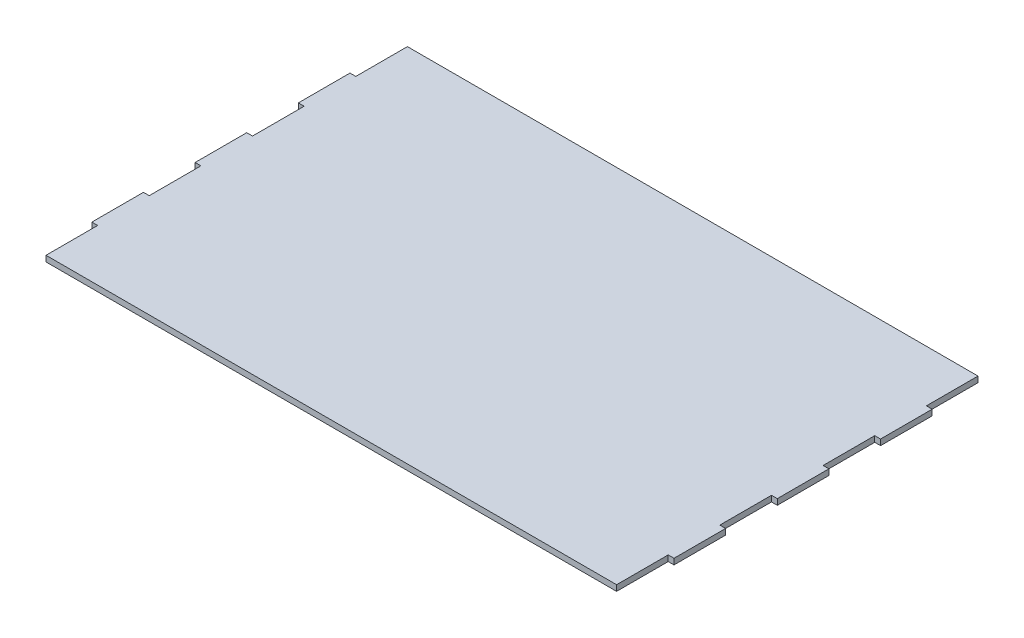
ISO-10303-21;
HEADER;
FILE_DESCRIPTION(('STEP AP214'),'2;1');
FILE_NAME('part.step','',(''),(''),'','','');
FILE_SCHEMA(('AUTOMOTIVE_DESIGN { 1 0 10303 214 1 1 1 1 }'));
ENDSEC;
DATA;
#1=APPLICATION_CONTEXT('core data for automotive mechanical design processes');
#2=APPLICATION_PROTOCOL_DEFINITION('international standard','automotive_design',2000,#1);
#3=PRODUCT_CONTEXT('',#1,'mechanical');
#4=PRODUCT('Part','Part','',(#3));
#5=PRODUCT_RELATED_PRODUCT_CATEGORY('part','',(#4));
#6=PRODUCT_DEFINITION_FORMATION('','',#4);
#7=PRODUCT_DEFINITION_CONTEXT('part definition',#1,'design');
#8=PRODUCT_DEFINITION('design','',#6,#7);
#9=PRODUCT_DEFINITION_SHAPE('','',#8);
#10=(LENGTH_UNIT() NAMED_UNIT(*) SI_UNIT(.MILLI.,.METRE.));
#11=(NAMED_UNIT(*) PLANE_ANGLE_UNIT() SI_UNIT($,.RADIAN.));
#12=(NAMED_UNIT(*) SI_UNIT($,.STERADIAN.) SOLID_ANGLE_UNIT());
#13=UNCERTAINTY_MEASURE_WITH_UNIT(LENGTH_MEASURE(1.E-05),#10,'distance_accuracy_value','');
#14=(GEOMETRIC_REPRESENTATION_CONTEXT(3) GLOBAL_UNCERTAINTY_ASSIGNED_CONTEXT((#13)) GLOBAL_UNIT_ASSIGNED_CONTEXT((#10,
#11,#12)) REPRESENTATION_CONTEXT('',''));
#15=CARTESIAN_POINT('',(0.,0.,0.));
#16=DIRECTION('',(0.,0.,1.));
#17=DIRECTION('',(1.,0.,0.));
#18=AXIS2_PLACEMENT_3D('',#15,#16,#17);
#19=CARTESIAN_POINT('',(-136.186205063659,3.,-47.9901598190306));
#20=DIRECTION('',(1.,0.,0.));
#21=DIRECTION('',(0.,0.,-1.));
#22=AXIS2_PLACEMENT_3D('',#19,#20,#21);
#23=PLANE('',#22);
#24=DIRECTION('',(0.,0.,1.));
#25=VECTOR('',#24,1.);
#26=CARTESIAN_POINT('',(-136.186205063659,0.,-47.9901598190306));
#27=LINE('',#26,#25);
#28=CARTESIAN_POINT('',(-136.186205063659,0.,-74.6901598190306));
#29=VERTEX_POINT('',#28);
#30=CARTESIAN_POINT('',(-136.186205063659,0.,-47.9901598190306));
#31=VERTEX_POINT('',#30);
#32=EDGE_CURVE('E257',#29,#31,#27,.T.);
#33=ORIENTED_EDGE('',*,*,#32,.T.);
#34=DIRECTION('',(0.,-1.,0.));
#35=VECTOR('',#34,1.);
#36=CARTESIAN_POINT('',(-136.186205063659,3.,-47.9901598190306));
#37=LINE('',#36,#35);
#38=CARTESIAN_POINT('',(-136.186205063659,3.,-47.9901598190306));
#39=VERTEX_POINT('',#38);
#40=EDGE_CURVE('E11',#39,#31,#37,.T.);
#41=ORIENTED_EDGE('',*,*,#40,.F.);
#42=DIRECTION('',(0.,0.,1.));
#43=VECTOR('',#42,1.);
#44=CARTESIAN_POINT('',(-136.186205063659,3.,-47.9901598190306));
#45=LINE('',#44,#43);
#46=CARTESIAN_POINT('',(-136.186205063659,3.,-74.6901598190306));
#47=VERTEX_POINT('',#46);
#48=EDGE_CURVE('E311',#47,#39,#45,.T.);
#49=ORIENTED_EDGE('',*,*,#48,.F.);
#50=DIRECTION('',(0.,-1.,0.));
#51=VECTOR('',#50,1.);
#52=CARTESIAN_POINT('',(-136.186205063659,3.,-74.6901598190306));
#53=LINE('',#52,#51);
#54=EDGE_CURVE('E253',#47,#29,#53,.T.);
#55=ORIENTED_EDGE('',*,*,#54,.T.);
#56=EDGE_LOOP('',(#33,#41,#49,#55));
#57=FACE_BOUND('',#56,.T.);
#58=ADVANCED_FACE('F41',(#57),#23,.F.);
#59=CARTESIAN_POINT('',(-139.186205063659,3.,-47.9901598190306));
#60=DIRECTION('',(0.,0.,1.));
#61=DIRECTION('',(1.,0.,0.));
#62=AXIS2_PLACEMENT_3D('',#59,#60,#61);
#63=PLANE('',#62);
#64=DIRECTION('',(-1.,0.,0.));
#65=VECTOR('',#64,1.);
#66=CARTESIAN_POINT('',(-139.186205063659,0.,-47.9901598190306));
#67=LINE('',#66,#65);
#68=CARTESIAN_POINT('',(-139.186205063659,0.,-47.9901598190306));
#69=VERTEX_POINT('',#68);
#70=EDGE_CURVE('E260',#31,#69,#67,.T.);
#71=ORIENTED_EDGE('',*,*,#70,.T.);
#72=DIRECTION('',(0.,-1.,0.));
#73=VECTOR('',#72,1.);
#74=CARTESIAN_POINT('',(-139.186205063659,3.,-47.9901598190306));
#75=LINE('',#74,#73);
#76=CARTESIAN_POINT('',(-139.186205063659,3.,-47.9901598190306));
#77=VERTEX_POINT('',#76);
#78=EDGE_CURVE('E49',#77,#69,#75,.T.);
#79=ORIENTED_EDGE('',*,*,#78,.F.);
#80=DIRECTION('',(-1.,0.,0.));
#81=VECTOR('',#80,1.);
#82=CARTESIAN_POINT('',(-139.186205063659,3.,-47.9901598190306));
#83=LINE('',#82,#81);
#84=EDGE_CURVE('E160',#39,#77,#83,.T.);
#85=ORIENTED_EDGE('',*,*,#84,.F.);
#86=ORIENTED_EDGE('',*,*,#40,.T.);
#87=EDGE_LOOP('',(#71,#79,#85,#86));
#88=FACE_BOUND('',#87,.T.);
#89=ADVANCED_FACE('F469',(#88),#63,.F.);
#90=CARTESIAN_POINT('',(-139.186205063659,3.,-21.2901598190306));
#91=DIRECTION('',(1.,0.,0.));
#92=DIRECTION('',(0.,0.,-1.));
#93=AXIS2_PLACEMENT_3D('',#90,#91,#92);
#94=PLANE('',#93);
#95=DIRECTION('',(0.,0.,1.));
#96=VECTOR('',#95,1.);
#97=CARTESIAN_POINT('',(-139.186205063659,0.,-21.2901598190306));
#98=LINE('',#97,#96);
#99=CARTESIAN_POINT('',(-139.186205063659,0.,-21.2901598190306));
#100=VERTEX_POINT('',#99);
#101=EDGE_CURVE('E262',#69,#100,#98,.T.);
#102=ORIENTED_EDGE('',*,*,#101,.T.);
#103=DIRECTION('',(0.,-1.,0.));
#104=VECTOR('',#103,1.);
#105=CARTESIAN_POINT('',(-139.186205063659,3.,-21.2901598190306));
#106=LINE('',#105,#104);
#107=CARTESIAN_POINT('',(-139.186205063659,3.,-21.2901598190306));
#108=VERTEX_POINT('',#107);
#109=EDGE_CURVE('E378',#108,#100,#106,.T.);
#110=ORIENTED_EDGE('',*,*,#109,.F.);
#111=DIRECTION('',(0.,0.,1.));
#112=VECTOR('',#111,1.);
#113=CARTESIAN_POINT('',(-139.186205063659,3.,-21.2901598190306));
#114=LINE('',#113,#112);
#115=EDGE_CURVE('E386',#77,#108,#114,.T.);
#116=ORIENTED_EDGE('',*,*,#115,.F.);
#117=ORIENTED_EDGE('',*,*,#78,.T.);
#118=EDGE_LOOP('',(#102,#110,#116,#117));
#119=FACE_BOUND('',#118,.T.);
#120=ADVANCED_FACE('F384',(#119),#94,.F.);
#121=CARTESIAN_POINT('',(-136.186205063659,3.,-21.2901598190306));
#122=DIRECTION('',(0.,0.,-1.));
#123=DIRECTION('',(-1.,0.,0.));
#124=AXIS2_PLACEMENT_3D('',#121,#122,#123);
#125=PLANE('',#124);
#126=DIRECTION('',(1.,0.,0.));
#127=VECTOR('',#126,1.);
#128=CARTESIAN_POINT('',(-136.186205063659,0.,-21.2901598190306));
#129=LINE('',#128,#127);
#130=CARTESIAN_POINT('',(-136.186205063659,0.,-21.2901598190306));
#131=VERTEX_POINT('',#130);
#132=EDGE_CURVE('E264',#100,#131,#129,.T.);
#133=ORIENTED_EDGE('',*,*,#132,.T.);
#134=DIRECTION('',(0.,-1.,0.));
#135=VECTOR('',#134,1.);
#136=CARTESIAN_POINT('',(-136.186205063659,3.,-21.2901598190306));
#137=LINE('',#136,#135);
#138=CARTESIAN_POINT('',(-136.186205063659,3.,-21.2901598190306));
#139=VERTEX_POINT('',#138);
#140=EDGE_CURVE('E375',#139,#131,#137,.T.);
#141=ORIENTED_EDGE('',*,*,#140,.F.);
#142=DIRECTION('',(1.,0.,0.));
#143=VECTOR('',#142,1.);
#144=CARTESIAN_POINT('',(-136.186205063659,3.,-21.2901598190306));
#145=LINE('',#144,#143);
#146=EDGE_CURVE('E404',#108,#139,#145,.T.);
#147=ORIENTED_EDGE('',*,*,#146,.F.);
#148=ORIENTED_EDGE('',*,*,#109,.T.);
#149=EDGE_LOOP('',(#133,#141,#147,#148));
#150=FACE_BOUND('',#149,.T.);
#151=ADVANCED_FACE('F395',(#150),#125,.F.);
#152=CARTESIAN_POINT('',(-136.186205063659,3.,5.4098401809694));
#153=DIRECTION('',(1.,0.,0.));
#154=DIRECTION('',(0.,0.,-1.));
#155=AXIS2_PLACEMENT_3D('',#152,#153,#154);
#156=PLANE('',#155);
#157=DIRECTION('',(0.,0.,1.));
#158=VECTOR('',#157,1.);
#159=CARTESIAN_POINT('',(-136.186205063659,0.,5.4098401809694));
#160=LINE('',#159,#158);
#161=CARTESIAN_POINT('',(-136.186205063659,0.,5.4098401809694));
#162=VERTEX_POINT('',#161);
#163=EDGE_CURVE('E266',#131,#162,#160,.T.);
#164=ORIENTED_EDGE('',*,*,#163,.T.);
#165=DIRECTION('',(0.,-1.,0.));
#166=VECTOR('',#165,1.);
#167=CARTESIAN_POINT('',(-136.186205063659,3.,5.4098401809694));
#168=LINE('',#167,#166);
#169=CARTESIAN_POINT('',(-136.186205063659,3.,5.4098401809694));
#170=VERTEX_POINT('',#169);
#171=EDGE_CURVE('E372',#170,#162,#168,.T.);
#172=ORIENTED_EDGE('',*,*,#171,.F.);
#173=DIRECTION('',(0.,0.,1.));
#174=VECTOR('',#173,1.);
#175=CARTESIAN_POINT('',(-136.186205063659,3.,5.4098401809694));
#176=LINE('',#175,#174);
#177=EDGE_CURVE('E401',#139,#170,#176,.T.);
#178=ORIENTED_EDGE('',*,*,#177,.F.);
#179=ORIENTED_EDGE('',*,*,#140,.T.);
#180=EDGE_LOOP('',(#164,#172,#178,#179));
#181=FACE_BOUND('',#180,.T.);
#182=ADVANCED_FACE('F399',(#181),#156,.F.);
#183=CARTESIAN_POINT('',(-136.186205063659,3.,5.4098401809694));
#184=DIRECTION('',(0.,0.,1.));
#185=DIRECTION('',(1.,0.,0.));
#186=AXIS2_PLACEMENT_3D('',#183,#184,#185);
#187=PLANE('',#186);
#188=DIRECTION('',(-1.,0.,0.));
#189=VECTOR('',#188,1.);
#190=CARTESIAN_POINT('',(-136.186205063659,0.,5.4098401809694));
#191=LINE('',#190,#189);
#192=CARTESIAN_POINT('',(-139.186205063659,0.,5.4098401809694));
#193=VERTEX_POINT('',#192);
#194=EDGE_CURVE('E268',#162,#193,#191,.T.);
#195=ORIENTED_EDGE('',*,*,#194,.T.);
#196=DIRECTION('',(0.,-1.,0.));
#197=VECTOR('',#196,1.);
#198=CARTESIAN_POINT('',(-139.186205063659,3.,5.4098401809694));
#199=LINE('',#198,#197);
#200=CARTESIAN_POINT('',(-139.186205063659,3.,5.4098401809694));
#201=VERTEX_POINT('',#200);
#202=EDGE_CURVE('E369',#201,#193,#199,.T.);
#203=ORIENTED_EDGE('',*,*,#202,.F.);
#204=DIRECTION('',(-1.,0.,0.));
#205=VECTOR('',#204,1.);
#206=CARTESIAN_POINT('',(-136.186205063659,3.,5.4098401809694));
#207=LINE('',#206,#205);
#208=EDGE_CURVE('E403',#170,#201,#207,.T.);
#209=ORIENTED_EDGE('',*,*,#208,.F.);
#210=ORIENTED_EDGE('',*,*,#171,.T.);
#211=EDGE_LOOP('',(#195,#203,#209,#210));
#212=FACE_BOUND('',#211,.T.);
#213=ADVANCED_FACE('F482',(#212),#187,.F.);
#214=CARTESIAN_POINT('',(-139.186205063659,3.,5.4098401809694));
#215=DIRECTION('',(1.,0.,0.));
#216=DIRECTION('',(0.,0.,-1.));
#217=AXIS2_PLACEMENT_3D('',#214,#215,#216);
#218=PLANE('',#217);
#219=DIRECTION('',(0.,0.,1.));
#220=VECTOR('',#219,1.);
#221=CARTESIAN_POINT('',(-139.186205063659,0.,5.4098401809694));
#222=LINE('',#221,#220);
#223=CARTESIAN_POINT('',(-139.186205063659,0.,32.1098401809694));
#224=VERTEX_POINT('',#223);
#225=EDGE_CURVE('E270',#193,#224,#222,.T.);
#226=ORIENTED_EDGE('',*,*,#225,.T.);
#227=DIRECTION('',(0.,-1.,0.));
#228=VECTOR('',#227,1.);
#229=CARTESIAN_POINT('',(-139.186205063659,3.,32.1098401809694));
#230=LINE('',#229,#228);
#231=CARTESIAN_POINT('',(-139.186205063659,3.,32.1098401809694));
#232=VERTEX_POINT('',#231);
#233=EDGE_CURVE('E366',#232,#224,#230,.T.);
#234=ORIENTED_EDGE('',*,*,#233,.F.);
#235=DIRECTION('',(0.,0.,1.));
#236=VECTOR('',#235,1.);
#237=CARTESIAN_POINT('',(-139.186205063659,3.,5.4098401809694));
#238=LINE('',#237,#236);
#239=EDGE_CURVE('E406',#201,#232,#238,.T.);
#240=ORIENTED_EDGE('',*,*,#239,.F.);
#241=ORIENTED_EDGE('',*,*,#202,.T.);
#242=EDGE_LOOP('',(#226,#234,#240,#241));
#243=FACE_BOUND('',#242,.T.);
#244=ADVANCED_FACE('F485',(#243),#218,.F.);
#245=CARTESIAN_POINT('',(-136.186205063659,3.,32.1098401809694));
#246=DIRECTION('',(0.,0.,-1.));
#247=DIRECTION('',(-1.,0.,0.));
#248=AXIS2_PLACEMENT_3D('',#245,#246,#247);
#249=PLANE('',#248);
#250=DIRECTION('',(1.,0.,0.));
#251=VECTOR('',#250,1.);
#252=CARTESIAN_POINT('',(-136.186205063659,0.,32.1098401809694));
#253=LINE('',#252,#251);
#254=CARTESIAN_POINT('',(-136.186205063659,0.,32.1098401809694));
#255=VERTEX_POINT('',#254);
#256=EDGE_CURVE('E272',#224,#255,#253,.T.);
#257=ORIENTED_EDGE('',*,*,#256,.T.);
#258=DIRECTION('',(0.,-1.,0.));
#259=VECTOR('',#258,1.);
#260=CARTESIAN_POINT('',(-136.186205063659,3.,32.1098401809694));
#261=LINE('',#260,#259);
#262=CARTESIAN_POINT('',(-136.186205063659,3.,32.1098401809694));
#263=VERTEX_POINT('',#262);
#264=EDGE_CURVE('E363',#263,#255,#261,.T.);
#265=ORIENTED_EDGE('',*,*,#264,.F.);
#266=DIRECTION('',(1.,0.,0.));
#267=VECTOR('',#266,1.);
#268=CARTESIAN_POINT('',(-136.186205063659,3.,32.1098401809694));
#269=LINE('',#268,#267);
#270=EDGE_CURVE('E412',#232,#263,#269,.T.);
#271=ORIENTED_EDGE('',*,*,#270,.F.);
#272=ORIENTED_EDGE('',*,*,#233,.T.);
#273=EDGE_LOOP('',(#257,#265,#271,#272));
#274=FACE_BOUND('',#273,.T.);
#275=ADVANCED_FACE('F489',(#274),#249,.F.);
#276=CARTESIAN_POINT('',(-136.186205063659,3.,32.1098401809694));
#277=DIRECTION('',(1.,0.,0.));
#278=DIRECTION('',(0.,0.,-1.));
#279=AXIS2_PLACEMENT_3D('',#276,#277,#278);
#280=PLANE('',#279);
#281=DIRECTION('',(0.,0.,1.));
#282=VECTOR('',#281,1.);
#283=CARTESIAN_POINT('',(-136.186205063659,0.,32.1098401809694));
#284=LINE('',#283,#282);
#285=CARTESIAN_POINT('',(-136.186205063659,0.,58.8098401809694));
#286=VERTEX_POINT('',#285);
#287=EDGE_CURVE('E274',#255,#286,#284,.T.);
#288=ORIENTED_EDGE('',*,*,#287,.T.);
#289=DIRECTION('',(0.,-1.,0.));
#290=VECTOR('',#289,1.);
#291=CARTESIAN_POINT('',(-136.186205063659,3.,58.8098401809694));
#292=LINE('',#291,#290);
#293=CARTESIAN_POINT('',(-136.186205063659,3.,58.8098401809694));
#294=VERTEX_POINT('',#293);
#295=EDGE_CURVE('E360',#294,#286,#292,.T.);
#296=ORIENTED_EDGE('',*,*,#295,.F.);
#297=DIRECTION('',(0.,0.,1.));
#298=VECTOR('',#297,1.);
#299=CARTESIAN_POINT('',(-136.186205063659,3.,32.1098401809694));
#300=LINE('',#299,#298);
#301=EDGE_CURVE('E414',#263,#294,#300,.T.);
#302=ORIENTED_EDGE('',*,*,#301,.F.);
#303=ORIENTED_EDGE('',*,*,#264,.T.);
#304=EDGE_LOOP('',(#288,#296,#302,#303));
#305=FACE_BOUND('',#304,.T.);
#306=ADVANCED_FACE('F493',(#305),#280,.F.);
#307=CARTESIAN_POINT('',(-136.186205063659,3.,58.8098401809694));
#308=DIRECTION('',(0.,0.,-1.));
#309=DIRECTION('',(-1.,0.,0.));
#310=AXIS2_PLACEMENT_3D('',#307,#308,#309);
#311=PLANE('',#310);
#312=DIRECTION('',(1.,0.,0.));
#313=VECTOR('',#312,1.);
#314=CARTESIAN_POINT('',(-136.186205063659,0.,58.8098401809694));
#315=LINE('',#314,#313);
#316=CARTESIAN_POINT('',(158.888122689838,0.,58.8098401809694));
#317=VERTEX_POINT('',#316);
#318=EDGE_CURVE('E276',#286,#317,#315,.T.);
#319=ORIENTED_EDGE('',*,*,#318,.T.);
#320=DIRECTION('',(0.,-1.,0.));
#321=VECTOR('',#320,1.);
#322=CARTESIAN_POINT('',(158.888122689838,3.,58.8098401809694));
#323=LINE('',#322,#321);
#324=CARTESIAN_POINT('',(158.888122689838,3.,58.8098401809694));
#325=VERTEX_POINT('',#324);
#326=EDGE_CURVE('E357',#325,#317,#323,.T.);
#327=ORIENTED_EDGE('',*,*,#326,.F.);
#328=DIRECTION('',(1.,0.,0.));
#329=VECTOR('',#328,1.);
#330=CARTESIAN_POINT('',(-136.186205063659,3.,58.8098401809694));
#331=LINE('',#330,#329);
#332=EDGE_CURVE('E416',#294,#325,#331,.T.);
#333=ORIENTED_EDGE('',*,*,#332,.F.);
#334=ORIENTED_EDGE('',*,*,#295,.T.);
#335=EDGE_LOOP('',(#319,#327,#333,#334));
#336=FACE_BOUND('',#335,.T.);
#337=ADVANCED_FACE('F497',(#336),#311,.F.);
#338=CARTESIAN_POINT('',(158.888122689838,3.,32.1098401809693));
#339=DIRECTION('',(-1.,0.,0.));
#340=DIRECTION('',(0.,0.,1.));
#341=AXIS2_PLACEMENT_3D('',#338,#339,#340);
#342=PLANE('',#341);
#343=DIRECTION('',(0.,0.,-1.));
#344=VECTOR('',#343,1.);
#345=CARTESIAN_POINT('',(158.888122689838,0.,32.1098401809693));
#346=LINE('',#345,#344);
#347=CARTESIAN_POINT('',(158.888122689838,0.,32.1098401809693));
#348=VERTEX_POINT('',#347);
#349=EDGE_CURVE('E278',#317,#348,#346,.T.);
#350=ORIENTED_EDGE('',*,*,#349,.T.);
#351=DIRECTION('',(0.,-1.,0.));
#352=VECTOR('',#351,1.);
#353=CARTESIAN_POINT('',(158.888122689838,3.,32.1098401809693));
#354=LINE('',#353,#352);
#355=CARTESIAN_POINT('',(158.888122689838,3.,32.1098401809693));
#356=VERTEX_POINT('',#355);
#357=EDGE_CURVE('E354',#356,#348,#354,.T.);
#358=ORIENTED_EDGE('',*,*,#357,.F.);
#359=DIRECTION('',(0.,0.,-1.));
#360=VECTOR('',#359,1.);
#361=CARTESIAN_POINT('',(158.888122689838,3.,32.1098401809693));
#362=LINE('',#361,#360);
#363=EDGE_CURVE('E418',#325,#356,#362,.T.);
#364=ORIENTED_EDGE('',*,*,#363,.F.);
#365=ORIENTED_EDGE('',*,*,#326,.T.);
#366=EDGE_LOOP('',(#350,#358,#364,#365));
#367=FACE_BOUND('',#366,.T.);
#368=ADVANCED_FACE('F501',(#367),#342,.F.);
#369=CARTESIAN_POINT('',(158.888122689838,3.,32.1098401809693));
#370=DIRECTION('',(0.,0.,-1.));
#371=DIRECTION('',(-1.,0.,0.));
#372=AXIS2_PLACEMENT_3D('',#369,#370,#371);
#373=PLANE('',#372);
#374=DIRECTION('',(1.,0.,0.));
#375=VECTOR('',#374,1.);
#376=CARTESIAN_POINT('',(158.888122689838,0.,32.1098401809693));
#377=LINE('',#376,#375);
#378=CARTESIAN_POINT('',(161.888122689838,0.,32.1098401809693));
#379=VERTEX_POINT('',#378);
#380=EDGE_CURVE('E280',#348,#379,#377,.T.);
#381=ORIENTED_EDGE('',*,*,#380,.T.);
#382=DIRECTION('',(0.,-1.,0.));
#383=VECTOR('',#382,1.);
#384=CARTESIAN_POINT('',(161.888122689838,3.,32.1098401809693));
#385=LINE('',#384,#383);
#386=CARTESIAN_POINT('',(161.888122689838,3.,32.1098401809693));
#387=VERTEX_POINT('',#386);
#388=EDGE_CURVE('E351',#387,#379,#385,.T.);
#389=ORIENTED_EDGE('',*,*,#388,.F.);
#390=DIRECTION('',(1.,0.,0.));
#391=VECTOR('',#390,1.);
#392=CARTESIAN_POINT('',(158.888122689838,3.,32.1098401809693));
#393=LINE('',#392,#391);
#394=EDGE_CURVE('E420',#356,#387,#393,.T.);
#395=ORIENTED_EDGE('',*,*,#394,.F.);
#396=ORIENTED_EDGE('',*,*,#357,.T.);
#397=EDGE_LOOP('',(#381,#389,#395,#396));
#398=FACE_BOUND('',#397,.T.);
#399=ADVANCED_FACE('F505',(#398),#373,.F.);
#400=CARTESIAN_POINT('',(161.888122689838,3.,5.40984018096936));
#401=DIRECTION('',(-1.,0.,0.));
#402=DIRECTION('',(0.,0.,1.));
#403=AXIS2_PLACEMENT_3D('',#400,#401,#402);
#404=PLANE('',#403);
#405=DIRECTION('',(0.,0.,-1.));
#406=VECTOR('',#405,1.);
#407=CARTESIAN_POINT('',(161.888122689838,0.,5.40984018096936));
#408=LINE('',#407,#406);
#409=CARTESIAN_POINT('',(161.888122689838,0.,5.40984018096936));
#410=VERTEX_POINT('',#409);
#411=EDGE_CURVE('E282',#379,#410,#408,.T.);
#412=ORIENTED_EDGE('',*,*,#411,.T.);
#413=DIRECTION('',(0.,-1.,0.));
#414=VECTOR('',#413,1.);
#415=CARTESIAN_POINT('',(161.888122689838,3.,5.40984018096936));
#416=LINE('',#415,#414);
#417=CARTESIAN_POINT('',(161.888122689838,3.,5.40984018096936));
#418=VERTEX_POINT('',#417);
#419=EDGE_CURVE('E348',#418,#410,#416,.T.);
#420=ORIENTED_EDGE('',*,*,#419,.F.);
#421=DIRECTION('',(0.,0.,-1.));
#422=VECTOR('',#421,1.);
#423=CARTESIAN_POINT('',(161.888122689838,3.,5.40984018096936));
#424=LINE('',#423,#422);
#425=EDGE_CURVE('E422',#387,#418,#424,.T.);
#426=ORIENTED_EDGE('',*,*,#425,.F.);
#427=ORIENTED_EDGE('',*,*,#388,.T.);
#428=EDGE_LOOP('',(#412,#420,#426,#427));
#429=FACE_BOUND('',#428,.T.);
#430=ADVANCED_FACE('F509',(#429),#404,.F.);
#431=CARTESIAN_POINT('',(158.888122689838,3.,5.40984018096935));
#432=DIRECTION('',(0.,0.,1.));
#433=DIRECTION('',(1.,0.,0.));
#434=AXIS2_PLACEMENT_3D('',#431,#432,#433);
#435=PLANE('',#434);
#436=DIRECTION('',(-1.,0.,0.));
#437=VECTOR('',#436,1.);
#438=CARTESIAN_POINT('',(158.888122689838,0.,5.40984018096935));
#439=LINE('',#438,#437);
#440=CARTESIAN_POINT('',(158.888122689838,0.,5.40984018096935));
#441=VERTEX_POINT('',#440);
#442=EDGE_CURVE('E284',#410,#441,#439,.T.);
#443=ORIENTED_EDGE('',*,*,#442,.T.);
#444=DIRECTION('',(0.,-1.,0.));
#445=VECTOR('',#444,1.);
#446=CARTESIAN_POINT('',(158.888122689838,3.,5.40984018096935));
#447=LINE('',#446,#445);
#448=CARTESIAN_POINT('',(158.888122689838,3.,5.40984018096935));
#449=VERTEX_POINT('',#448);
#450=EDGE_CURVE('E345',#449,#441,#447,.T.);
#451=ORIENTED_EDGE('',*,*,#450,.F.);
#452=DIRECTION('',(-1.,0.,0.));
#453=VECTOR('',#452,1.);
#454=CARTESIAN_POINT('',(158.888122689838,3.,5.40984018096935));
#455=LINE('',#454,#453);
#456=EDGE_CURVE('E424',#418,#449,#455,.T.);
#457=ORIENTED_EDGE('',*,*,#456,.F.);
#458=ORIENTED_EDGE('',*,*,#419,.T.);
#459=EDGE_LOOP('',(#443,#451,#457,#458));
#460=FACE_BOUND('',#459,.T.);
#461=ADVANCED_FACE('F513',(#460),#435,.F.);
#462=CARTESIAN_POINT('',(158.888122689838,3.,5.40984018096935));
#463=DIRECTION('',(-1.,0.,0.));
#464=DIRECTION('',(0.,0.,1.));
#465=AXIS2_PLACEMENT_3D('',#462,#463,#464);
#466=PLANE('',#465);
#467=DIRECTION('',(0.,0.,-1.));
#468=VECTOR('',#467,1.);
#469=CARTESIAN_POINT('',(158.888122689838,0.,5.40984018096935));
#470=LINE('',#469,#468);
#471=CARTESIAN_POINT('',(158.888122689838,0.,-21.2901598190307));
#472=VERTEX_POINT('',#471);
#473=EDGE_CURVE('E286',#441,#472,#470,.T.);
#474=ORIENTED_EDGE('',*,*,#473,.T.);
#475=DIRECTION('',(0.,-1.,0.));
#476=VECTOR('',#475,1.);
#477=CARTESIAN_POINT('',(158.888122689838,3.,-21.2901598190307));
#478=LINE('',#477,#476);
#479=CARTESIAN_POINT('',(158.888122689838,3.,-21.2901598190307));
#480=VERTEX_POINT('',#479);
#481=EDGE_CURVE('E342',#480,#472,#478,.T.);
#482=ORIENTED_EDGE('',*,*,#481,.F.);
#483=DIRECTION('',(0.,0.,-1.));
#484=VECTOR('',#483,1.);
#485=CARTESIAN_POINT('',(158.888122689838,3.,5.40984018096935));
#486=LINE('',#485,#484);
#487=EDGE_CURVE('E426',#449,#480,#486,.T.);
#488=ORIENTED_EDGE('',*,*,#487,.F.);
#489=ORIENTED_EDGE('',*,*,#450,.T.);
#490=EDGE_LOOP('',(#474,#482,#488,#489));
#491=FACE_BOUND('',#490,.T.);
#492=ADVANCED_FACE('F517',(#491),#466,.F.);
#493=CARTESIAN_POINT('',(158.888122689838,3.,-21.2901598190307));
#494=DIRECTION('',(0.,0.,-1.));
#495=DIRECTION('',(-1.,0.,0.));
#496=AXIS2_PLACEMENT_3D('',#493,#494,#495);
#497=PLANE('',#496);
#498=DIRECTION('',(1.,0.,0.));
#499=VECTOR('',#498,1.);
#500=CARTESIAN_POINT('',(158.888122689838,0.,-21.2901598190307));
#501=LINE('',#500,#499);
#502=CARTESIAN_POINT('',(161.888122689838,0.,-21.2901598190307));
#503=VERTEX_POINT('',#502);
#504=EDGE_CURVE('E288',#472,#503,#501,.T.);
#505=ORIENTED_EDGE('',*,*,#504,.T.);
#506=DIRECTION('',(0.,-1.,0.));
#507=VECTOR('',#506,1.);
#508=CARTESIAN_POINT('',(161.888122689838,3.,-21.2901598190307));
#509=LINE('',#508,#507);
#510=CARTESIAN_POINT('',(161.888122689838,3.,-21.2901598190307));
#511=VERTEX_POINT('',#510);
#512=EDGE_CURVE('E339',#511,#503,#509,.T.);
#513=ORIENTED_EDGE('',*,*,#512,.F.);
#514=DIRECTION('',(1.,0.,0.));
#515=VECTOR('',#514,1.);
#516=CARTESIAN_POINT('',(158.888122689838,3.,-21.2901598190307));
#517=LINE('',#516,#515);
#518=EDGE_CURVE('E428',#480,#511,#517,.T.);
#519=ORIENTED_EDGE('',*,*,#518,.F.);
#520=ORIENTED_EDGE('',*,*,#481,.T.);
#521=EDGE_LOOP('',(#505,#513,#519,#520));
#522=FACE_BOUND('',#521,.T.);
#523=ADVANCED_FACE('F521',(#522),#497,.F.);
#524=CARTESIAN_POINT('',(161.888122689838,3.,-21.2901598190307));
#525=DIRECTION('',(-1.,0.,0.));
#526=DIRECTION('',(0.,0.,1.));
#527=AXIS2_PLACEMENT_3D('',#524,#525,#526);
#528=PLANE('',#527);
#529=DIRECTION('',(0.,0.,-1.));
#530=VECTOR('',#529,1.);
#531=CARTESIAN_POINT('',(161.888122689838,0.,-21.2901598190307));
#532=LINE('',#531,#530);
#533=CARTESIAN_POINT('',(161.888122689838,0.,-47.9901598190307));
#534=VERTEX_POINT('',#533);
#535=EDGE_CURVE('E290',#503,#534,#532,.T.);
#536=ORIENTED_EDGE('',*,*,#535,.T.);
#537=DIRECTION('',(0.,-1.,0.));
#538=VECTOR('',#537,1.);
#539=CARTESIAN_POINT('',(161.888122689838,3.,-47.9901598190307));
#540=LINE('',#539,#538);
#541=CARTESIAN_POINT('',(161.888122689838,3.,-47.9901598190307));
#542=VERTEX_POINT('',#541);
#543=EDGE_CURVE('E336',#542,#534,#540,.T.);
#544=ORIENTED_EDGE('',*,*,#543,.F.);
#545=DIRECTION('',(0.,0.,-1.));
#546=VECTOR('',#545,1.);
#547=CARTESIAN_POINT('',(161.888122689838,3.,-21.2901598190307));
#548=LINE('',#547,#546);
#549=EDGE_CURVE('E430',#511,#542,#548,.T.);
#550=ORIENTED_EDGE('',*,*,#549,.F.);
#551=ORIENTED_EDGE('',*,*,#512,.T.);
#552=EDGE_LOOP('',(#536,#544,#550,#551));
#553=FACE_BOUND('',#552,.T.);
#554=ADVANCED_FACE('F525',(#553),#528,.F.);
#555=CARTESIAN_POINT('',(161.888122689838,3.,-47.9901598190307));
#556=DIRECTION('',(0.,0.,1.));
#557=DIRECTION('',(1.,0.,0.));
#558=AXIS2_PLACEMENT_3D('',#555,#556,#557);
#559=PLANE('',#558);
#560=DIRECTION('',(-1.,0.,0.));
#561=VECTOR('',#560,1.);
#562=CARTESIAN_POINT('',(161.888122689838,0.,-47.9901598190307));
#563=LINE('',#562,#561);
#564=CARTESIAN_POINT('',(158.888122689838,0.,-47.9901598190307));
#565=VERTEX_POINT('',#564);
#566=EDGE_CURVE('E292',#534,#565,#563,.T.);
#567=ORIENTED_EDGE('',*,*,#566,.T.);
#568=DIRECTION('',(0.,-1.,0.));
#569=VECTOR('',#568,1.);
#570=CARTESIAN_POINT('',(158.888122689838,3.,-47.9901598190307));
#571=LINE('',#570,#569);
#572=CARTESIAN_POINT('',(158.888122689838,3.,-47.9901598190307));
#573=VERTEX_POINT('',#572);
#574=EDGE_CURVE('E333',#573,#565,#571,.T.);
#575=ORIENTED_EDGE('',*,*,#574,.F.);
#576=DIRECTION('',(-1.,0.,0.));
#577=VECTOR('',#576,1.);
#578=CARTESIAN_POINT('',(161.888122689838,3.,-47.9901598190307));
#579=LINE('',#578,#577);
#580=EDGE_CURVE('E432',#542,#573,#579,.T.);
#581=ORIENTED_EDGE('',*,*,#580,.F.);
#582=ORIENTED_EDGE('',*,*,#543,.T.);
#583=EDGE_LOOP('',(#567,#575,#581,#582));
#584=FACE_BOUND('',#583,.T.);
#585=ADVANCED_FACE('F529',(#584),#559,.F.);
#586=CARTESIAN_POINT('',(158.888122689838,3.,-47.9901598190307));
#587=DIRECTION('',(-1.,0.,0.));
#588=DIRECTION('',(0.,0.,1.));
#589=AXIS2_PLACEMENT_3D('',#586,#587,#588);
#590=PLANE('',#589);
#591=DIRECTION('',(0.,0.,-1.));
#592=VECTOR('',#591,1.);
#593=CARTESIAN_POINT('',(158.888122689838,0.,-47.9901598190307));
#594=LINE('',#593,#592);
#595=CARTESIAN_POINT('',(158.888122689838,0.,-74.6901598190307));
#596=VERTEX_POINT('',#595);
#597=EDGE_CURVE('E294',#565,#596,#594,.T.);
#598=ORIENTED_EDGE('',*,*,#597,.T.);
#599=DIRECTION('',(0.,-1.,0.));
#600=VECTOR('',#599,1.);
#601=CARTESIAN_POINT('',(158.888122689838,3.,-74.6901598190307));
#602=LINE('',#601,#600);
#603=CARTESIAN_POINT('',(158.888122689838,3.,-74.6901598190307));
#604=VERTEX_POINT('',#603);
#605=EDGE_CURVE('E330',#604,#596,#602,.T.);
#606=ORIENTED_EDGE('',*,*,#605,.F.);
#607=DIRECTION('',(0.,0.,-1.));
#608=VECTOR('',#607,1.);
#609=CARTESIAN_POINT('',(158.888122689838,3.,-47.9901598190307));
#610=LINE('',#609,#608);
#611=EDGE_CURVE('E434',#573,#604,#610,.T.);
#612=ORIENTED_EDGE('',*,*,#611,.F.);
#613=ORIENTED_EDGE('',*,*,#574,.T.);
#614=EDGE_LOOP('',(#598,#606,#612,#613));
#615=FACE_BOUND('',#614,.T.);
#616=ADVANCED_FACE('F533',(#615),#590,.F.);
#617=CARTESIAN_POINT('',(158.888122689838,3.,-74.6901598190307));
#618=DIRECTION('',(0.,0.,-1.));
#619=DIRECTION('',(-1.,0.,0.));
#620=AXIS2_PLACEMENT_3D('',#617,#618,#619);
#621=PLANE('',#620);
#622=DIRECTION('',(1.,0.,0.));
#623=VECTOR('',#622,1.);
#624=CARTESIAN_POINT('',(158.888122689838,0.,-74.6901598190307));
#625=LINE('',#624,#623);
#626=CARTESIAN_POINT('',(161.888122689838,0.,-74.6901598190307));
#627=VERTEX_POINT('',#626);
#628=EDGE_CURVE('E296',#596,#627,#625,.T.);
#629=ORIENTED_EDGE('',*,*,#628,.T.);
#630=DIRECTION('',(0.,-1.,0.));
#631=VECTOR('',#630,1.);
#632=CARTESIAN_POINT('',(161.888122689838,3.,-74.6901598190307));
#633=LINE('',#632,#631);
#634=CARTESIAN_POINT('',(161.888122689838,3.,-74.6901598190307));
#635=VERTEX_POINT('',#634);
#636=EDGE_CURVE('E327',#635,#627,#633,.T.);
#637=ORIENTED_EDGE('',*,*,#636,.F.);
#638=DIRECTION('',(1.,0.,0.));
#639=VECTOR('',#638,1.);
#640=CARTESIAN_POINT('',(158.888122689838,3.,-74.6901598190307));
#641=LINE('',#640,#639);
#642=EDGE_CURVE('E436',#604,#635,#641,.T.);
#643=ORIENTED_EDGE('',*,*,#642,.F.);
#644=ORIENTED_EDGE('',*,*,#605,.T.);
#645=EDGE_LOOP('',(#629,#637,#643,#644));
#646=FACE_BOUND('',#645,.T.);
#647=ADVANCED_FACE('F537',(#646),#621,.F.);
#648=CARTESIAN_POINT('',(161.888122689838,3.,-74.6901598190307));
#649=DIRECTION('',(-1.,0.,0.));
#650=DIRECTION('',(0.,0.,1.));
#651=AXIS2_PLACEMENT_3D('',#648,#649,#650);
#652=PLANE('',#651);
#653=DIRECTION('',(0.,0.,-1.));
#654=VECTOR('',#653,1.);
#655=CARTESIAN_POINT('',(161.888122689838,0.,-74.6901598190307));
#656=LINE('',#655,#654);
#657=CARTESIAN_POINT('',(161.888122689838,0.,-101.390159819031));
#658=VERTEX_POINT('',#657);
#659=EDGE_CURVE('E298',#627,#658,#656,.T.);
#660=ORIENTED_EDGE('',*,*,#659,.T.);
#661=DIRECTION('',(0.,-1.,0.));
#662=VECTOR('',#661,1.);
#663=CARTESIAN_POINT('',(161.888122689838,3.,-101.390159819031));
#664=LINE('',#663,#662);
#665=CARTESIAN_POINT('',(161.888122689838,3.,-101.390159819031));
#666=VERTEX_POINT('',#665);
#667=EDGE_CURVE('E324',#666,#658,#664,.T.);
#668=ORIENTED_EDGE('',*,*,#667,.F.);
#669=DIRECTION('',(0.,0.,-1.));
#670=VECTOR('',#669,1.);
#671=CARTESIAN_POINT('',(161.888122689838,3.,-74.6901598190307));
#672=LINE('',#671,#670);
#673=EDGE_CURVE('E438',#635,#666,#672,.T.);
#674=ORIENTED_EDGE('',*,*,#673,.F.);
#675=ORIENTED_EDGE('',*,*,#636,.T.);
#676=EDGE_LOOP('',(#660,#668,#674,#675));
#677=FACE_BOUND('',#676,.T.);
#678=ADVANCED_FACE('F541',(#677),#652,.F.);
#679=CARTESIAN_POINT('',(161.888122689838,3.,-101.390159819031));
#680=DIRECTION('',(0.,0.,1.));
#681=DIRECTION('',(1.,0.,0.));
#682=AXIS2_PLACEMENT_3D('',#679,#680,#681);
#683=PLANE('',#682);
#684=DIRECTION('',(-1.,0.,0.));
#685=VECTOR('',#684,1.);
#686=CARTESIAN_POINT('',(161.888122689838,0.,-101.390159819031));
#687=LINE('',#686,#685);
#688=CARTESIAN_POINT('',(158.888122689838,0.,-101.390159819031));
#689=VERTEX_POINT('',#688);
#690=EDGE_CURVE('E300',#658,#689,#687,.T.);
#691=ORIENTED_EDGE('',*,*,#690,.T.);
#692=DIRECTION('',(0.,-1.,0.));
#693=VECTOR('',#692,1.);
#694=CARTESIAN_POINT('',(158.888122689838,3.,-101.390159819031));
#695=LINE('',#694,#693);
#696=CARTESIAN_POINT('',(158.888122689838,3.,-101.390159819031));
#697=VERTEX_POINT('',#696);
#698=EDGE_CURVE('E321',#697,#689,#695,.T.);
#699=ORIENTED_EDGE('',*,*,#698,.F.);
#700=DIRECTION('',(-1.,0.,0.));
#701=VECTOR('',#700,1.);
#702=CARTESIAN_POINT('',(161.888122689838,3.,-101.390159819031));
#703=LINE('',#702,#701);
#704=EDGE_CURVE('E440',#666,#697,#703,.T.);
#705=ORIENTED_EDGE('',*,*,#704,.F.);
#706=ORIENTED_EDGE('',*,*,#667,.T.);
#707=EDGE_LOOP('',(#691,#699,#705,#706));
#708=FACE_BOUND('',#707,.T.);
#709=ADVANCED_FACE('F545',(#708),#683,.F.);
#710=CARTESIAN_POINT('',(158.888122689838,3.,-101.390159819031));
#711=DIRECTION('',(-1.,0.,0.));
#712=DIRECTION('',(0.,0.,1.));
#713=AXIS2_PLACEMENT_3D('',#710,#711,#712);
#714=PLANE('',#713);
#715=DIRECTION('',(0.,0.,-1.));
#716=VECTOR('',#715,1.);
#717=CARTESIAN_POINT('',(158.888122689838,0.,-101.390159819031));
#718=LINE('',#717,#716);
#719=CARTESIAN_POINT('',(158.888122689838,0.,-128.090159819031));
#720=VERTEX_POINT('',#719);
#721=EDGE_CURVE('E302',#689,#720,#718,.T.);
#722=ORIENTED_EDGE('',*,*,#721,.T.);
#723=DIRECTION('',(0.,-1.,0.));
#724=VECTOR('',#723,1.);
#725=CARTESIAN_POINT('',(158.888122689838,3.,-128.090159819031));
#726=LINE('',#725,#724);
#727=CARTESIAN_POINT('',(158.888122689838,3.,-128.090159819031));
#728=VERTEX_POINT('',#727);
#729=EDGE_CURVE('E318',#728,#720,#726,.T.);
#730=ORIENTED_EDGE('',*,*,#729,.F.);
#731=DIRECTION('',(0.,0.,-1.));
#732=VECTOR('',#731,1.);
#733=CARTESIAN_POINT('',(158.888122689838,3.,-101.390159819031));
#734=LINE('',#733,#732);
#735=EDGE_CURVE('E442',#697,#728,#734,.T.);
#736=ORIENTED_EDGE('',*,*,#735,.F.);
#737=ORIENTED_EDGE('',*,*,#698,.T.);
#738=EDGE_LOOP('',(#722,#730,#736,#737));
#739=FACE_BOUND('',#738,.T.);
#740=ADVANCED_FACE('F549',(#739),#714,.F.);
#741=CARTESIAN_POINT('',(-136.186205063659,3.,-128.090159819031));
#742=DIRECTION('',(0.,0.,1.));
#743=DIRECTION('',(1.,0.,0.));
#744=AXIS2_PLACEMENT_3D('',#741,#742,#743);
#745=PLANE('',#744);
#746=DIRECTION('',(-1.,0.,0.));
#747=VECTOR('',#746,1.);
#748=CARTESIAN_POINT('',(-136.186205063659,0.,-128.090159819031));
#749=LINE('',#748,#747);
#750=CARTESIAN_POINT('',(-136.186205063659,0.,-128.090159819031));
#751=VERTEX_POINT('',#750);
#752=EDGE_CURVE('E304',#720,#751,#749,.T.);
#753=ORIENTED_EDGE('',*,*,#752,.T.);
#754=DIRECTION('',(0.,-1.,0.));
#755=VECTOR('',#754,1.);
#756=CARTESIAN_POINT('',(-136.186205063659,3.,-128.090159819031));
#757=LINE('',#756,#755);
#758=CARTESIAN_POINT('',(-136.186205063659,3.,-128.090159819031));
#759=VERTEX_POINT('',#758);
#760=EDGE_CURVE('E315',#759,#751,#757,.T.);
#761=ORIENTED_EDGE('',*,*,#760,.F.);
#762=DIRECTION('',(-1.,0.,0.));
#763=VECTOR('',#762,1.);
#764=CARTESIAN_POINT('',(-136.186205063659,3.,-128.090159819031));
#765=LINE('',#764,#763);
#766=EDGE_CURVE('E444',#728,#759,#765,.T.);
#767=ORIENTED_EDGE('',*,*,#766,.F.);
#768=ORIENTED_EDGE('',*,*,#729,.T.);
#769=EDGE_LOOP('',(#753,#761,#767,#768));
#770=FACE_BOUND('',#769,.T.);
#771=ADVANCED_FACE('F450',(#770),#745,.F.);
#772=CARTESIAN_POINT('',(-136.186205063659,3.,-101.390159819031));
#773=DIRECTION('',(1.,0.,0.));
#774=DIRECTION('',(0.,0.,-1.));
#775=AXIS2_PLACEMENT_3D('',#772,#773,#774);
#776=PLANE('',#775);
#777=DIRECTION('',(0.,0.,1.));
#778=VECTOR('',#777,1.);
#779=CARTESIAN_POINT('',(-136.186205063659,0.,-101.390159819031));
#780=LINE('',#779,#778);
#781=CARTESIAN_POINT('',(-136.186205063659,0.,-101.390159819031));
#782=VERTEX_POINT('',#781);
#783=EDGE_CURVE('E306',#751,#782,#780,.T.);
#784=ORIENTED_EDGE('',*,*,#783,.T.);
#785=DIRECTION('',(0.,-1.,0.));
#786=VECTOR('',#785,1.);
#787=CARTESIAN_POINT('',(-136.186205063659,3.,-101.390159819031));
#788=LINE('',#787,#786);
#789=CARTESIAN_POINT('',(-136.186205063659,3.,-101.390159819031));
#790=VERTEX_POINT('',#789);
#791=EDGE_CURVE('E248',#790,#782,#788,.T.);
#792=ORIENTED_EDGE('',*,*,#791,.F.);
#793=DIRECTION('',(0.,0.,1.));
#794=VECTOR('',#793,1.);
#795=CARTESIAN_POINT('',(-136.186205063659,3.,-101.390159819031));
#796=LINE('',#795,#794);
#797=EDGE_CURVE('E239',#759,#790,#796,.T.);
#798=ORIENTED_EDGE('',*,*,#797,.F.);
#799=ORIENTED_EDGE('',*,*,#760,.T.);
#800=EDGE_LOOP('',(#784,#792,#798,#799));
#801=FACE_BOUND('',#800,.T.);
#802=ADVANCED_FACE('F454',(#801),#776,.F.);
#803=CARTESIAN_POINT('',(-139.186205063659,3.,-101.390159819031));
#804=DIRECTION('',(0.,0.,1.));
#805=DIRECTION('',(1.,0.,0.));
#806=AXIS2_PLACEMENT_3D('',#803,#804,#805);
#807=PLANE('',#806);
#808=DIRECTION('',(-1.,0.,0.));
#809=VECTOR('',#808,1.);
#810=CARTESIAN_POINT('',(-139.186205063659,0.,-101.390159819031));
#811=LINE('',#810,#809);
#812=CARTESIAN_POINT('',(-139.186205063659,0.,-101.390159819031));
#813=VERTEX_POINT('',#812);
#814=EDGE_CURVE('E247',#782,#813,#811,.T.);
#815=ORIENTED_EDGE('',*,*,#814,.T.);
#816=DIRECTION('',(0.,-1.,0.));
#817=VECTOR('',#816,1.);
#818=CARTESIAN_POINT('',(-139.186205063659,3.,-101.390159819031));
#819=LINE('',#818,#817);
#820=CARTESIAN_POINT('',(-139.186205063659,3.,-101.390159819031));
#821=VERTEX_POINT('',#820);
#822=EDGE_CURVE('E244',#821,#813,#819,.T.);
#823=ORIENTED_EDGE('',*,*,#822,.F.);
#824=DIRECTION('',(-1.,0.,0.));
#825=VECTOR('',#824,1.);
#826=CARTESIAN_POINT('',(-139.186205063659,3.,-101.390159819031));
#827=LINE('',#826,#825);
#828=EDGE_CURVE('E233',#790,#821,#827,.T.);
#829=ORIENTED_EDGE('',*,*,#828,.F.);
#830=ORIENTED_EDGE('',*,*,#791,.T.);
#831=EDGE_LOOP('',(#815,#823,#829,#830));
#832=FACE_BOUND('',#831,.T.);
#833=ADVANCED_FACE('F245',(#832),#807,.F.);
#834=CARTESIAN_POINT('',(-139.186205063659,3.,-74.6901598190306));
#835=DIRECTION('',(1.,0.,0.));
#836=DIRECTION('',(0.,0.,-1.));
#837=AXIS2_PLACEMENT_3D('',#834,#835,#836);
#838=PLANE('',#837);
#839=DIRECTION('',(0.,0.,1.));
#840=VECTOR('',#839,1.);
#841=CARTESIAN_POINT('',(-139.186205063659,0.,-74.6901598190306));
#842=LINE('',#841,#840);
#843=CARTESIAN_POINT('',(-139.186205063659,0.,-74.6901598190306));
#844=VERTEX_POINT('',#843);
#845=EDGE_CURVE('E146',#813,#844,#842,.T.);
#846=ORIENTED_EDGE('',*,*,#845,.T.);
#847=DIRECTION('',(0.,-1.,0.));
#848=VECTOR('',#847,1.);
#849=CARTESIAN_POINT('',(-139.186205063659,3.,-74.6901598190306));
#850=LINE('',#849,#848);
#851=CARTESIAN_POINT('',(-139.186205063659,3.,-74.6901598190306));
#852=VERTEX_POINT('',#851);
#853=EDGE_CURVE('E249',#852,#844,#850,.T.);
#854=ORIENTED_EDGE('',*,*,#853,.F.);
#855=DIRECTION('',(0.,0.,1.));
#856=VECTOR('',#855,1.);
#857=CARTESIAN_POINT('',(-139.186205063659,3.,-74.6901598190306));
#858=LINE('',#857,#856);
#859=EDGE_CURVE('E237',#821,#852,#858,.T.);
#860=ORIENTED_EDGE('',*,*,#859,.F.);
#861=ORIENTED_EDGE('',*,*,#822,.T.);
#862=EDGE_LOOP('',(#846,#854,#860,#861));
#863=FACE_BOUND('',#862,.T.);
#864=ADVANCED_FACE('F251',(#863),#838,.F.);
#865=CARTESIAN_POINT('',(-136.186205063659,3.,-74.6901598190306));
#866=DIRECTION('',(0.,0.,-1.));
#867=DIRECTION('',(-1.,0.,0.));
#868=AXIS2_PLACEMENT_3D('',#865,#866,#867);
#869=PLANE('',#868);
#870=DIRECTION('',(1.,0.,0.));
#871=VECTOR('',#870,1.);
#872=CARTESIAN_POINT('',(-136.186205063659,0.,-74.6901598190306));
#873=LINE('',#872,#871);
#874=EDGE_CURVE('E152',#844,#29,#873,.T.);
#875=ORIENTED_EDGE('',*,*,#874,.T.);
#876=ORIENTED_EDGE('',*,*,#54,.F.);
#877=DIRECTION('',(1.,0.,0.));
#878=VECTOR('',#877,1.);
#879=CARTESIAN_POINT('',(-136.186205063659,3.,-74.6901598190306));
#880=LINE('',#879,#878);
#881=EDGE_CURVE('E57',#852,#47,#880,.T.);
#882=ORIENTED_EDGE('',*,*,#881,.F.);
#883=ORIENTED_EDGE('',*,*,#853,.T.);
#884=EDGE_LOOP('',(#875,#876,#882,#883));
#885=FACE_BOUND('',#884,.T.);
#886=ADVANCED_FACE('F458',(#885),#869,.F.);
#887=CARTESIAN_POINT('',(0.,3.,0.));
#888=DIRECTION('',(0.,1.,0.));
#889=DIRECTION('',(0.,0.,1.));
#890=AXIS2_PLACEMENT_3D('',#887,#888,#889);
#891=PLANE('',#890);
#892=ORIENTED_EDGE('',*,*,#48,.T.);
#893=ORIENTED_EDGE('',*,*,#84,.T.);
#894=ORIENTED_EDGE('',*,*,#115,.T.);
#895=ORIENTED_EDGE('',*,*,#146,.T.);
#896=ORIENTED_EDGE('',*,*,#177,.T.);
#897=ORIENTED_EDGE('',*,*,#208,.T.);
#898=ORIENTED_EDGE('',*,*,#239,.T.);
#899=ORIENTED_EDGE('',*,*,#270,.T.);
#900=ORIENTED_EDGE('',*,*,#301,.T.);
#901=ORIENTED_EDGE('',*,*,#332,.T.);
#902=ORIENTED_EDGE('',*,*,#363,.T.);
#903=ORIENTED_EDGE('',*,*,#394,.T.);
#904=ORIENTED_EDGE('',*,*,#425,.T.);
#905=ORIENTED_EDGE('',*,*,#456,.T.);
#906=ORIENTED_EDGE('',*,*,#487,.T.);
#907=ORIENTED_EDGE('',*,*,#518,.T.);
#908=ORIENTED_EDGE('',*,*,#549,.T.);
#909=ORIENTED_EDGE('',*,*,#580,.T.);
#910=ORIENTED_EDGE('',*,*,#611,.T.);
#911=ORIENTED_EDGE('',*,*,#642,.T.);
#912=ORIENTED_EDGE('',*,*,#673,.T.);
#913=ORIENTED_EDGE('',*,*,#704,.T.);
#914=ORIENTED_EDGE('',*,*,#735,.T.);
#915=ORIENTED_EDGE('',*,*,#766,.T.);
#916=ORIENTED_EDGE('',*,*,#797,.T.);
#917=ORIENTED_EDGE('',*,*,#828,.T.);
#918=ORIENTED_EDGE('',*,*,#859,.T.);
#919=ORIENTED_EDGE('',*,*,#881,.T.);
#920=EDGE_LOOP('',(#892,#893,#894,#895,#896,#897,#898,#899,#900,#901,#902,#903,#904,#905,#906,
#907,#908,#909,#910,#911,#912,#913,#914,#915,#916,#917,#918,#919));
#921=FACE_BOUND('',#920,.T.);
#922=ADVANCED_FACE('F235',(#921),#891,.T.);
#923=CARTESIAN_POINT('',(0.,0.,0.));
#924=DIRECTION('',(0.,1.,0.));
#925=DIRECTION('',(0.,0.,1.));
#926=AXIS2_PLACEMENT_3D('',#923,#924,#925);
#927=PLANE('',#926);
#928=ORIENTED_EDGE('',*,*,#32,.F.);
#929=ORIENTED_EDGE('',*,*,#874,.F.);
#930=ORIENTED_EDGE('',*,*,#845,.F.);
#931=ORIENTED_EDGE('',*,*,#814,.F.);
#932=ORIENTED_EDGE('',*,*,#783,.F.);
#933=ORIENTED_EDGE('',*,*,#752,.F.);
#934=ORIENTED_EDGE('',*,*,#721,.F.);
#935=ORIENTED_EDGE('',*,*,#690,.F.);
#936=ORIENTED_EDGE('',*,*,#659,.F.);
#937=ORIENTED_EDGE('',*,*,#628,.F.);
#938=ORIENTED_EDGE('',*,*,#597,.F.);
#939=ORIENTED_EDGE('',*,*,#566,.F.);
#940=ORIENTED_EDGE('',*,*,#535,.F.);
#941=ORIENTED_EDGE('',*,*,#504,.F.);
#942=ORIENTED_EDGE('',*,*,#473,.F.);
#943=ORIENTED_EDGE('',*,*,#442,.F.);
#944=ORIENTED_EDGE('',*,*,#411,.F.);
#945=ORIENTED_EDGE('',*,*,#380,.F.);
#946=ORIENTED_EDGE('',*,*,#349,.F.);
#947=ORIENTED_EDGE('',*,*,#318,.F.);
#948=ORIENTED_EDGE('',*,*,#287,.F.);
#949=ORIENTED_EDGE('',*,*,#256,.F.);
#950=ORIENTED_EDGE('',*,*,#225,.F.);
#951=ORIENTED_EDGE('',*,*,#194,.F.);
#952=ORIENTED_EDGE('',*,*,#163,.F.);
#953=ORIENTED_EDGE('',*,*,#132,.F.);
#954=ORIENTED_EDGE('',*,*,#101,.F.);
#955=ORIENTED_EDGE('',*,*,#70,.F.);
#956=EDGE_LOOP('',(#928,#929,#930,#931,#932,#933,#934,#935,#936,#937,#938,#939,#940,#941,#942,
#943,#944,#945,#946,#947,#948,#949,#950,#951,#952,#953,#954,#955));
#957=FACE_BOUND('',#956,.T.);
#958=ADVANCED_FACE('F390',(#957),#927,.F.);
#959=CLOSED_SHELL('',(#58,#89,#120,#151,#182,#213,#244,#275,#306,#337,#368,#399,#430,#461,#492,
#523,#554,#585,#616,#647,#678,#709,#740,#771,#802,#833,#864,#886,#922,#958));
#960=MANIFOLD_SOLID_BREP('B2',#959);
#961=ADVANCED_BREP_SHAPE_REPRESENTATION('',(#18,#960),#14);
#962=SHAPE_DEFINITION_REPRESENTATION(#9,#961);
ENDSEC;
END-ISO-10303-21;
